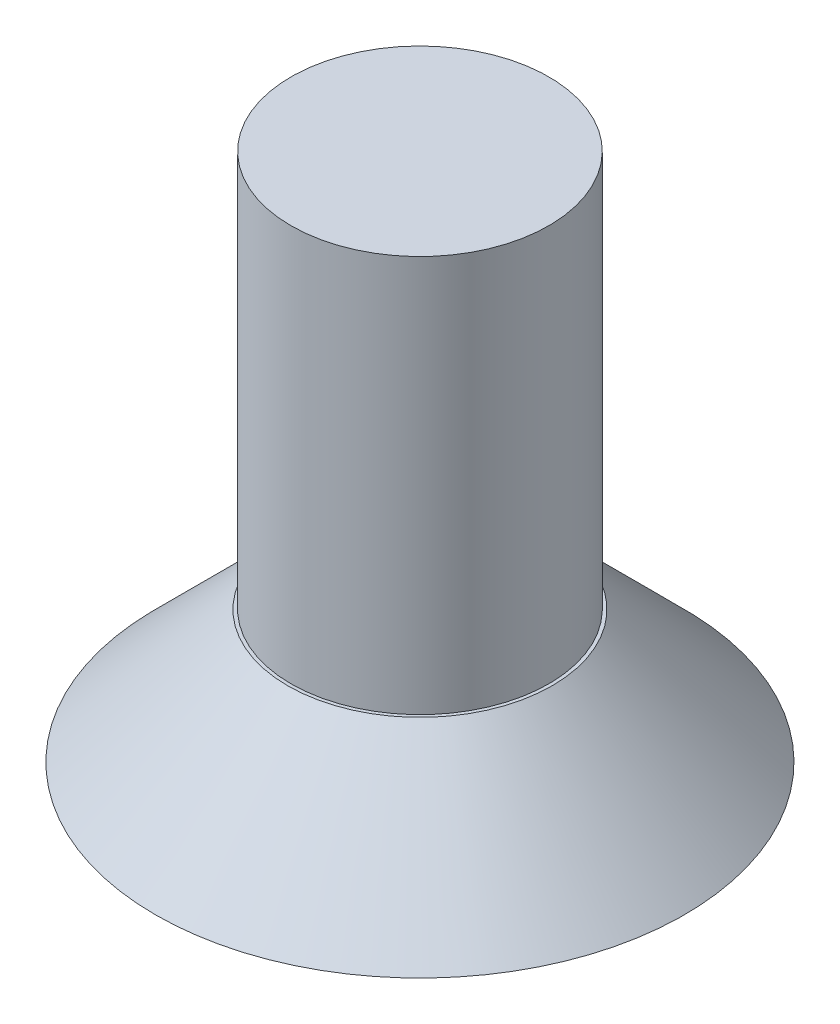
ISO-10303-21;
HEADER;
FILE_DESCRIPTION(('STEP AP214'),'2;1');
FILE_NAME('part.step','',(''),(''),'','','');
FILE_SCHEMA(('AUTOMOTIVE_DESIGN { 1 0 10303 214 1 1 1 1 }'));
ENDSEC;
DATA;
#1=APPLICATION_CONTEXT('core data for automotive mechanical design processes');
#2=APPLICATION_PROTOCOL_DEFINITION('international standard','automotive_design',2000,#1);
#3=PRODUCT_CONTEXT('',#1,'mechanical');
#4=PRODUCT('Part','Part','',(#3));
#5=PRODUCT_RELATED_PRODUCT_CATEGORY('part','',(#4));
#6=PRODUCT_DEFINITION_FORMATION('','',#4);
#7=PRODUCT_DEFINITION_CONTEXT('part definition',#1,'design');
#8=PRODUCT_DEFINITION('design','',#6,#7);
#9=PRODUCT_DEFINITION_SHAPE('','',#8);
#10=(LENGTH_UNIT() NAMED_UNIT(*) SI_UNIT(.MILLI.,.METRE.));
#11=(NAMED_UNIT(*) PLANE_ANGLE_UNIT() SI_UNIT($,.RADIAN.));
#12=(NAMED_UNIT(*) SI_UNIT($,.STERADIAN.) SOLID_ANGLE_UNIT());
#13=UNCERTAINTY_MEASURE_WITH_UNIT(LENGTH_MEASURE(1.E-05),#10,'distance_accuracy_value','');
#14=(GEOMETRIC_REPRESENTATION_CONTEXT(3) GLOBAL_UNCERTAINTY_ASSIGNED_CONTEXT((#13)) GLOBAL_UNIT_ASSIGNED_CONTEXT((#10,
#11,#12)) REPRESENTATION_CONTEXT('',''));
#15=CARTESIAN_POINT('',(0.,0.,0.));
#16=DIRECTION('',(0.,0.,1.));
#17=DIRECTION('',(1.,0.,0.));
#18=AXIS2_PLACEMENT_3D('',#15,#16,#17);
#19=CARTESIAN_POINT('',(0.,2.,0.));
#20=DIRECTION('',(0.,1.,0.));
#21=DIRECTION('',(0.,0.,1.));
#22=AXIS2_PLACEMENT_3D('',#19,#20,#21);
#23=PLANE('',#22);
#24=CARTESIAN_POINT('',(0.,2.,0.));
#25=DIRECTION('',(0.,1.,0.));
#26=DIRECTION('',(0.,0.,1.));
#27=AXIS2_PLACEMENT_3D('',#24,#25,#26);
#28=CIRCLE('',#27,2.);
#29=CARTESIAN_POINT('',(0.,2.,2.));
#30=VERTEX_POINT('',#29);
#31=EDGE_CURVE('E11',#30,#30,#28,.T.);
#32=ORIENTED_EDGE('',*,*,#31,.T.);
#33=EDGE_LOOP('',(#32));
#34=FACE_BOUND('',#33,.T.);
#35=CARTESIAN_POINT('',(0.,2.,0.));
#36=DIRECTION('',(0.,1.,0.));
#37=DIRECTION('',(0.,0.,1.));
#38=AXIS2_PLACEMENT_3D('',#35,#36,#37);
#39=CIRCLE('',#38,1.95);
#40=CARTESIAN_POINT('',(0.,2.,1.95));
#41=VERTEX_POINT('',#40);
#42=EDGE_CURVE('E45',#41,#41,#39,.T.);
#43=ORIENTED_EDGE('',*,*,#42,.F.);
#44=EDGE_LOOP('',(#43));
#45=FACE_BOUND('',#44,.T.);
#46=ADVANCED_FACE('F36',(#34,#45),#23,.T.);
#47=CARTESIAN_POINT('',(0.,0.,0.));
#48=DIRECTION('',(0.,1.,0.));
#49=DIRECTION('',(0.,0.,1.));
#50=AXIS2_PLACEMENT_3D('',#47,#48,#49);
#51=PLANE('',#50);
#52=DIRECTION('',(0.866025403784438,0.,0.500000000000001));
#53=VECTOR('',#52,1.);
#54=CARTESIAN_POINT('',(0.,0.,-1.66247090152183));
#55=LINE('',#54,#53);
#56=CARTESIAN_POINT('',(0.,0.,-1.66247090152183));
#57=VERTEX_POINT('',#56);
#58=CARTESIAN_POINT('',(1.43974203377032,0.,-0.831235450760911));
#59=VERTEX_POINT('',#58);
#60=EDGE_CURVE('E126',#57,#59,#55,.T.);
#61=ORIENTED_EDGE('',*,*,#60,.F.);
#62=DIRECTION('',(0.866025403784441,0.,-0.499999999999995));
#63=VECTOR('',#62,1.);
#64=CARTESIAN_POINT('',(-1.43974203377031,0.,-0.831235450760931));
#65=LINE('',#64,#63);
#66=CARTESIAN_POINT('',(-1.43974203377031,0.,-0.831235450760931));
#67=VERTEX_POINT('',#66);
#68=EDGE_CURVE('E52',#67,#57,#65,.T.);
#69=ORIENTED_EDGE('',*,*,#68,.F.);
#70=DIRECTION('',(0.,0.,-1.));
#71=VECTOR('',#70,1.);
#72=CARTESIAN_POINT('',(-1.43974203377033,0.,0.831235450760901));
#73=LINE('',#72,#71);
#74=CARTESIAN_POINT('',(-1.43974203377033,0.,0.831235450760901));
#75=VERTEX_POINT('',#74);
#76=EDGE_CURVE('E135',#75,#67,#73,.T.);
#77=ORIENTED_EDGE('',*,*,#76,.F.);
#78=DIRECTION('',(-0.866025403784434,0.,-0.500000000000007));
#79=VECTOR('',#78,1.);
#80=CARTESIAN_POINT('',(0.,0.,1.66247090152183));
#81=LINE('',#80,#79);
#82=CARTESIAN_POINT('',(0.,0.,1.66247090152183));
#83=VERTEX_POINT('',#82);
#84=EDGE_CURVE('E133',#83,#75,#81,.T.);
#85=ORIENTED_EDGE('',*,*,#84,.F.);
#86=DIRECTION('',(-0.866025403784442,0.,0.499999999999995));
#87=VECTOR('',#86,1.);
#88=CARTESIAN_POINT('',(1.43974203377032,0.,0.831235450760921));
#89=LINE('',#88,#87);
#90=CARTESIAN_POINT('',(1.43974203377032,0.,0.831235450760921));
#91=VERTEX_POINT('',#90);
#92=EDGE_CURVE('E100',#91,#83,#89,.T.);
#93=ORIENTED_EDGE('',*,*,#92,.F.);
#94=DIRECTION('',(0.,0.,1.));
#95=VECTOR('',#94,1.);
#96=CARTESIAN_POINT('',(1.43974203377032,0.,-0.831235450760911));
#97=LINE('',#96,#95);
#98=EDGE_CURVE('E129',#59,#91,#97,.T.);
#99=ORIENTED_EDGE('',*,*,#98,.F.);
#100=EDGE_LOOP('',(#61,#69,#77,#85,#93,#99));
#101=FACE_BOUND('',#100,.T.);
#102=CARTESIAN_POINT('',(0.,0.,0.));
#103=DIRECTION('',(0.,1.,0.));
#104=DIRECTION('',(0.,0.,1.));
#105=AXIS2_PLACEMENT_3D('',#102,#103,#104);
#106=CIRCLE('',#105,4.);
#107=CARTESIAN_POINT('',(0.,0.,4.));
#108=VERTEX_POINT('',#107);
#109=EDGE_CURVE('E147',#108,#108,#106,.T.);
#110=ORIENTED_EDGE('',*,*,#109,.F.);
#111=EDGE_LOOP('',(#110));
#112=FACE_BOUND('',#111,.T.);
#113=ADVANCED_FACE('F154',(#101,#112),#51,.F.);
#114=CARTESIAN_POINT('',(0.,8.,0.));
#115=DIRECTION('',(0.,-1.,0.));
#116=DIRECTION('',(0.,0.,-1.));
#117=AXIS2_PLACEMENT_3D('',#114,#115,#116);
#118=CYLINDRICAL_SURFACE('',#117,1.95);
#119=CARTESIAN_POINT('',(0.,8.,0.));
#120=DIRECTION('',(0.,1.,0.));
#121=DIRECTION('',(0.,0.,1.));
#122=AXIS2_PLACEMENT_3D('',#119,#120,#121);
#123=CIRCLE('',#122,1.95);
#124=CARTESIAN_POINT('',(0.,8.,1.95));
#125=VERTEX_POINT('',#124);
#126=EDGE_CURVE('E139',#125,#125,#123,.T.);
#127=ORIENTED_EDGE('',*,*,#126,.F.);
#128=EDGE_LOOP('',(#127));
#129=FACE_BOUND('',#128,.T.);
#130=ORIENTED_EDGE('',*,*,#42,.T.);
#131=EDGE_LOOP('',(#130));
#132=FACE_BOUND('',#131,.T.);
#133=ADVANCED_FACE('F156',(#129,#132),#118,.T.);
#134=CARTESIAN_POINT('',(0.,8.,0.));
#135=DIRECTION('',(0.,1.,0.));
#136=DIRECTION('',(0.,0.,1.));
#137=AXIS2_PLACEMENT_3D('',#134,#135,#136);
#138=PLANE('',#137);
#139=ORIENTED_EDGE('',*,*,#126,.T.);
#140=EDGE_LOOP('',(#139));
#141=FACE_BOUND('',#140,.T.);
#142=ADVANCED_FACE('F162',(#141),#138,.T.);
#143=CARTESIAN_POINT('',(0.,2.,0.));
#144=DIRECTION('',(0.,-1.,0.));
#145=DIRECTION('',(0.,0.,-1.));
#146=AXIS2_PLACEMENT_3D('',#143,#144,#145);
#147=CONICAL_SURFACE('',#146,2.,0.785398163397447);
#148=ORIENTED_EDGE('',*,*,#109,.T.);
#149=EDGE_LOOP('',(#148));
#150=FACE_BOUND('',#149,.T.);
#151=ORIENTED_EDGE('',*,*,#31,.F.);
#152=EDGE_LOOP('',(#151));
#153=FACE_BOUND('',#152,.T.);
#154=ADVANCED_FACE('F39',(#150,#153),#147,.T.);
#155=CARTESIAN_POINT('',(-1.43974203377031,1.5,-0.831235450760931));
#156=DIRECTION('',(-0.499999999999995,0.,-0.866025403784441));
#157=DIRECTION('',(-0.866025403784441,0.,0.499999999999995));
#158=AXIS2_PLACEMENT_3D('',#155,#156,#157);
#159=PLANE('',#158);
#160=ORIENTED_EDGE('',*,*,#68,.T.);
#161=DIRECTION('',(0.,-1.,0.));
#162=VECTOR('',#161,1.);
#163=CARTESIAN_POINT('',(0.,1.5,-1.66247090152183));
#164=LINE('',#163,#162);
#165=CARTESIAN_POINT('',(0.,1.5,-1.66247090152183));
#166=VERTEX_POINT('',#165);
#167=EDGE_CURVE('E82',#166,#57,#164,.T.);
#168=ORIENTED_EDGE('',*,*,#167,.F.);
#169=DIRECTION('',(0.866025403784441,0.,-0.499999999999995));
#170=VECTOR('',#169,1.);
#171=CARTESIAN_POINT('',(-1.43974203377031,1.5,-0.831235450760931));
#172=LINE('',#171,#170);
#173=CARTESIAN_POINT('',(-1.43974203377031,1.5,-0.831235450760931));
#174=VERTEX_POINT('',#173);
#175=EDGE_CURVE('E137',#174,#166,#172,.T.);
#176=ORIENTED_EDGE('',*,*,#175,.F.);
#177=DIRECTION('',(0.,-1.,0.));
#178=VECTOR('',#177,1.);
#179=CARTESIAN_POINT('',(-1.43974203377031,1.5,-0.831235450760931));
#180=LINE('',#179,#178);
#181=EDGE_CURVE('E60',#174,#67,#180,.T.);
#182=ORIENTED_EDGE('',*,*,#181,.T.);
#183=EDGE_LOOP('',(#160,#168,#176,#182));
#184=FACE_BOUND('',#183,.T.);
#185=ADVANCED_FACE('F172',(#184),#159,.F.);
#186=CARTESIAN_POINT('',(-1.43974203377033,1.5,0.831235450760901));
#187=DIRECTION('',(-1.,0.,0.));
#188=DIRECTION('',(0.,0.,1.));
#189=AXIS2_PLACEMENT_3D('',#186,#187,#188);
#190=PLANE('',#189);
#191=ORIENTED_EDGE('',*,*,#76,.T.);
#192=ORIENTED_EDGE('',*,*,#181,.F.);
#193=DIRECTION('',(0.,0.,-1.));
#194=VECTOR('',#193,1.);
#195=CARTESIAN_POINT('',(-1.43974203377033,1.5,0.831235450760901));
#196=LINE('',#195,#194);
#197=CARTESIAN_POINT('',(-1.43974203377033,1.5,0.831235450760901));
#198=VERTEX_POINT('',#197);
#199=EDGE_CURVE('E112',#198,#174,#196,.T.);
#200=ORIENTED_EDGE('',*,*,#199,.F.);
#201=DIRECTION('',(0.,-1.,0.));
#202=VECTOR('',#201,1.);
#203=CARTESIAN_POINT('',(-1.43974203377033,1.5,0.831235450760901));
#204=LINE('',#203,#202);
#205=EDGE_CURVE('E104',#198,#75,#204,.T.);
#206=ORIENTED_EDGE('',*,*,#205,.T.);
#207=EDGE_LOOP('',(#191,#192,#200,#206));
#208=FACE_BOUND('',#207,.T.);
#209=ADVANCED_FACE('F175',(#208),#190,.F.);
#210=CARTESIAN_POINT('',(0.,1.5,1.66247090152183));
#211=DIRECTION('',(-0.500000000000007,0.,0.866025403784435));
#212=DIRECTION('',(0.866025403784434,0.,0.500000000000007));
#213=AXIS2_PLACEMENT_3D('',#210,#211,#212);
#214=PLANE('',#213);
#215=ORIENTED_EDGE('',*,*,#84,.T.);
#216=ORIENTED_EDGE('',*,*,#205,.F.);
#217=DIRECTION('',(-0.866025403784434,0.,-0.500000000000007));
#218=VECTOR('',#217,1.);
#219=CARTESIAN_POINT('',(0.,1.5,1.66247090152183));
#220=LINE('',#219,#218);
#221=CARTESIAN_POINT('',(0.,1.5,1.66247090152183));
#222=VERTEX_POINT('',#221);
#223=EDGE_CURVE('E108',#222,#198,#220,.T.);
#224=ORIENTED_EDGE('',*,*,#223,.F.);
#225=DIRECTION('',(0.,-1.,0.));
#226=VECTOR('',#225,1.);
#227=CARTESIAN_POINT('',(0.,1.5,1.66247090152183));
#228=LINE('',#227,#226);
#229=EDGE_CURVE('E93',#222,#83,#228,.T.);
#230=ORIENTED_EDGE('',*,*,#229,.T.);
#231=EDGE_LOOP('',(#215,#216,#224,#230));
#232=FACE_BOUND('',#231,.T.);
#233=ADVANCED_FACE('F109',(#232),#214,.F.);
#234=CARTESIAN_POINT('',(1.43974203377032,1.5,0.831235450760921));
#235=DIRECTION('',(0.499999999999995,0.,0.866025403784441));
#236=DIRECTION('',(0.866025403784442,0.,-0.499999999999995));
#237=AXIS2_PLACEMENT_3D('',#234,#235,#236);
#238=PLANE('',#237);
#239=ORIENTED_EDGE('',*,*,#92,.T.);
#240=ORIENTED_EDGE('',*,*,#229,.F.);
#241=DIRECTION('',(-0.866025403784442,0.,0.499999999999995));
#242=VECTOR('',#241,1.);
#243=CARTESIAN_POINT('',(1.43974203377032,1.5,0.831235450760921));
#244=LINE('',#243,#242);
#245=CARTESIAN_POINT('',(1.43974203377032,1.5,0.831235450760921));
#246=VERTEX_POINT('',#245);
#247=EDGE_CURVE('E97',#246,#222,#244,.T.);
#248=ORIENTED_EDGE('',*,*,#247,.F.);
#249=DIRECTION('',(0.,-1.,0.));
#250=VECTOR('',#249,1.);
#251=CARTESIAN_POINT('',(1.43974203377032,1.5,0.831235450760921));
#252=LINE('',#251,#250);
#253=EDGE_CURVE('E105',#246,#91,#252,.T.);
#254=ORIENTED_EDGE('',*,*,#253,.T.);
#255=EDGE_LOOP('',(#239,#240,#248,#254));
#256=FACE_BOUND('',#255,.T.);
#257=ADVANCED_FACE('F95',(#256),#238,.F.);
#258=CARTESIAN_POINT('',(1.43974203377032,1.5,-0.831235450760911));
#259=DIRECTION('',(1.,0.,0.));
#260=DIRECTION('',(0.,0.,-1.));
#261=AXIS2_PLACEMENT_3D('',#258,#259,#260);
#262=PLANE('',#261);
#263=ORIENTED_EDGE('',*,*,#98,.T.);
#264=ORIENTED_EDGE('',*,*,#253,.F.);
#265=DIRECTION('',(0.,0.,1.));
#266=VECTOR('',#265,1.);
#267=CARTESIAN_POINT('',(1.43974203377032,1.5,-0.831235450760911));
#268=LINE('',#267,#266);
#269=CARTESIAN_POINT('',(1.43974203377032,1.5,-0.831235450760911));
#270=VERTEX_POINT('',#269);
#271=EDGE_CURVE('E118',#270,#246,#268,.T.);
#272=ORIENTED_EDGE('',*,*,#271,.F.);
#273=DIRECTION('',(0.,-1.,0.));
#274=VECTOR('',#273,1.);
#275=CARTESIAN_POINT('',(1.43974203377032,1.5,-0.831235450760911));
#276=LINE('',#275,#274);
#277=EDGE_CURVE('E142',#270,#59,#276,.T.);
#278=ORIENTED_EDGE('',*,*,#277,.T.);
#279=EDGE_LOOP('',(#263,#264,#272,#278));
#280=FACE_BOUND('',#279,.T.);
#281=ADVANCED_FACE('F179',(#280),#262,.F.);
#282=CARTESIAN_POINT('',(0.,1.5,-1.66247090152183));
#283=DIRECTION('',(0.500000000000001,0.,-0.866025403784438));
#284=DIRECTION('',(-0.866025403784438,0.,-0.500000000000001));
#285=AXIS2_PLACEMENT_3D('',#282,#283,#284);
#286=PLANE('',#285);
#287=ORIENTED_EDGE('',*,*,#60,.T.);
#288=ORIENTED_EDGE('',*,*,#277,.F.);
#289=DIRECTION('',(0.866025403784438,0.,0.500000000000001));
#290=VECTOR('',#289,1.);
#291=CARTESIAN_POINT('',(0.,1.5,-1.66247090152183));
#292=LINE('',#291,#290);
#293=EDGE_CURVE('E120',#166,#270,#292,.T.);
#294=ORIENTED_EDGE('',*,*,#293,.F.);
#295=ORIENTED_EDGE('',*,*,#167,.T.);
#296=EDGE_LOOP('',(#287,#288,#294,#295));
#297=FACE_BOUND('',#296,.T.);
#298=ADVANCED_FACE('F176',(#297),#286,.F.);
#299=CARTESIAN_POINT('',(0.,1.5,0.));
#300=DIRECTION('',(0.,-1.,0.));
#301=DIRECTION('',(0.,0.,-1.));
#302=AXIS2_PLACEMENT_3D('',#299,#300,#301);
#303=PLANE('',#302);
#304=ORIENTED_EDGE('',*,*,#175,.T.);
#305=ORIENTED_EDGE('',*,*,#293,.T.);
#306=ORIENTED_EDGE('',*,*,#271,.T.);
#307=ORIENTED_EDGE('',*,*,#247,.T.);
#308=ORIENTED_EDGE('',*,*,#223,.T.);
#309=ORIENTED_EDGE('',*,*,#199,.T.);
#310=EDGE_LOOP('',(#304,#305,#306,#307,#308,#309));
#311=FACE_BOUND('',#310,.T.);
#312=ADVANCED_FACE('F115',(#311),#303,.T.);
#313=CLOSED_SHELL('',(#46,#113,#133,#142,#154,#185,#209,#233,#257,#281,#298,#312));
#314=MANIFOLD_SOLID_BREP('B2',#313);
#315=ADVANCED_BREP_SHAPE_REPRESENTATION('',(#18,#314),#14);
#316=SHAPE_DEFINITION_REPRESENTATION(#9,#315);
ENDSEC;
END-ISO-10303-21;
